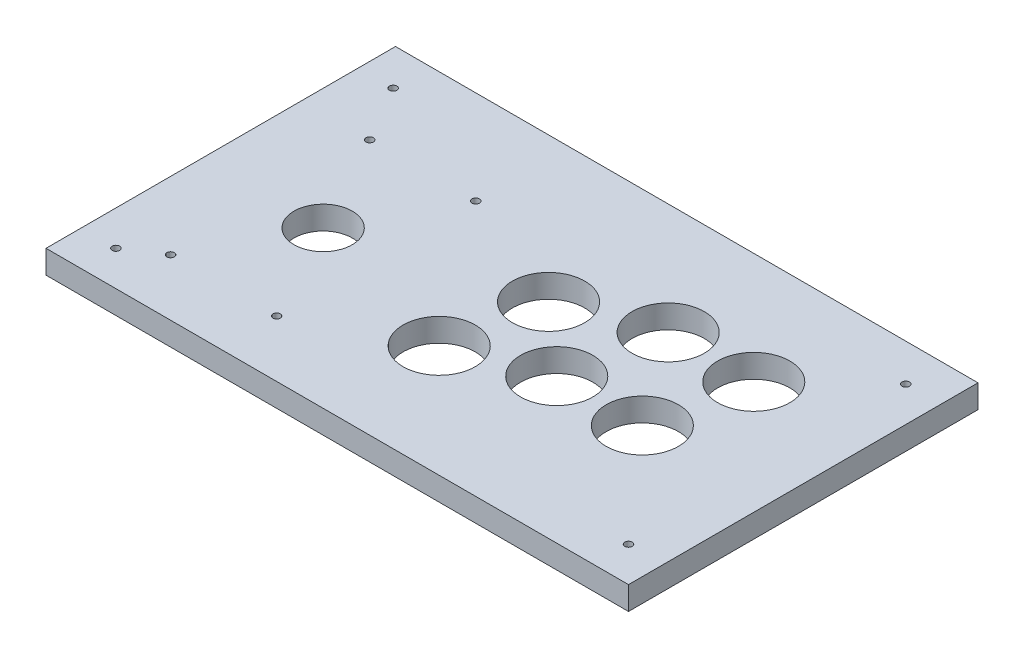
ISO-10303-21;
HEADER;
FILE_DESCRIPTION(('STEP AP214'),'2;1');
FILE_NAME('part.step','',(''),(''),'','','');
FILE_SCHEMA(('AUTOMOTIVE_DESIGN { 1 0 10303 214 1 1 1 1 }'));
ENDSEC;
DATA;
#1=APPLICATION_CONTEXT('core data for automotive mechanical design processes');
#2=APPLICATION_PROTOCOL_DEFINITION('international standard','automotive_design',2000,#1);
#3=PRODUCT_CONTEXT('',#1,'mechanical');
#4=PRODUCT('Part','Part','',(#3));
#5=PRODUCT_RELATED_PRODUCT_CATEGORY('part','',(#4));
#6=PRODUCT_DEFINITION_FORMATION('','',#4);
#7=PRODUCT_DEFINITION_CONTEXT('part definition',#1,'design');
#8=PRODUCT_DEFINITION('design','',#6,#7);
#9=PRODUCT_DEFINITION_SHAPE('','',#8);
#10=(LENGTH_UNIT() NAMED_UNIT(*) SI_UNIT(.MILLI.,.METRE.));
#11=(NAMED_UNIT(*) PLANE_ANGLE_UNIT() SI_UNIT($,.RADIAN.));
#12=(NAMED_UNIT(*) SI_UNIT($,.STERADIAN.) SOLID_ANGLE_UNIT());
#13=UNCERTAINTY_MEASURE_WITH_UNIT(LENGTH_MEASURE(1.E-05),#10,'distance_accuracy_value','');
#14=(GEOMETRIC_REPRESENTATION_CONTEXT(3) GLOBAL_UNCERTAINTY_ASSIGNED_CONTEXT((#13)) GLOBAL_UNIT_ASSIGNED_CONTEXT((#10,
#11,#12)) REPRESENTATION_CONTEXT('',''));
#15=CARTESIAN_POINT('',(0.,0.,0.));
#16=DIRECTION('',(0.,0.,1.));
#17=DIRECTION('',(1.,0.,0.));
#18=AXIS2_PLACEMENT_3D('',#15,#16,#17);
#19=CARTESIAN_POINT('',(125.,10.,-75.));
#20=DIRECTION('',(-1.,0.,0.));
#21=DIRECTION('',(0.,0.,1.));
#22=AXIS2_PLACEMENT_3D('',#19,#20,#21);
#23=PLANE('',#22);
#24=DIRECTION('',(0.,0.,-1.));
#25=VECTOR('',#24,1.);
#26=CARTESIAN_POINT('',(125.,0.,-75.));
#27=LINE('',#26,#25);
#28=CARTESIAN_POINT('',(125.,0.,75.));
#29=VERTEX_POINT('',#28);
#30=CARTESIAN_POINT('',(125.,0.,-75.));
#31=VERTEX_POINT('',#30);
#32=EDGE_CURVE('E96',#29,#31,#27,.T.);
#33=ORIENTED_EDGE('',*,*,#32,.T.);
#34=DIRECTION('',(0.,-1.,0.));
#35=VECTOR('',#34,1.);
#36=CARTESIAN_POINT('',(125.,10.,-75.));
#37=LINE('',#36,#35);
#38=CARTESIAN_POINT('',(125.,10.,-75.));
#39=VERTEX_POINT('',#38);
#40=EDGE_CURVE('E11',#39,#31,#37,.T.);
#41=ORIENTED_EDGE('',*,*,#40,.F.);
#42=DIRECTION('',(0.,0.,-1.));
#43=VECTOR('',#42,1.);
#44=CARTESIAN_POINT('',(125.,10.,-75.));
#45=LINE('',#44,#43);
#46=CARTESIAN_POINT('',(125.,10.,75.));
#47=VERTEX_POINT('',#46);
#48=EDGE_CURVE('E84',#47,#39,#45,.T.);
#49=ORIENTED_EDGE('',*,*,#48,.F.);
#50=DIRECTION('',(0.,-1.,0.));
#51=VECTOR('',#50,1.);
#52=CARTESIAN_POINT('',(125.,10.,75.));
#53=LINE('',#52,#51);
#54=EDGE_CURVE('E92',#47,#29,#53,.T.);
#55=ORIENTED_EDGE('',*,*,#54,.T.);
#56=EDGE_LOOP('',(#33,#41,#49,#55));
#57=FACE_BOUND('',#56,.T.);
#58=ADVANCED_FACE('F33',(#57),#23,.F.);
#59=CARTESIAN_POINT('',(-125.,10.,-75.));
#60=DIRECTION('',(0.,0.,1.));
#61=DIRECTION('',(1.,0.,0.));
#62=AXIS2_PLACEMENT_3D('',#59,#60,#61);
#63=PLANE('',#62);
#64=DIRECTION('',(-1.,0.,0.));
#65=VECTOR('',#64,1.);
#66=CARTESIAN_POINT('',(-125.,0.,-75.));
#67=LINE('',#66,#65);
#68=CARTESIAN_POINT('',(-125.,0.,-75.));
#69=VERTEX_POINT('',#68);
#70=EDGE_CURVE('E88',#31,#69,#67,.T.);
#71=ORIENTED_EDGE('',*,*,#70,.T.);
#72=DIRECTION('',(0.,-1.,0.));
#73=VECTOR('',#72,1.);
#74=CARTESIAN_POINT('',(-125.,10.,-75.));
#75=LINE('',#74,#73);
#76=CARTESIAN_POINT('',(-125.,10.,-75.));
#77=VERTEX_POINT('',#76);
#78=EDGE_CURVE('E41',#77,#69,#75,.T.);
#79=ORIENTED_EDGE('',*,*,#78,.F.);
#80=DIRECTION('',(-1.,0.,0.));
#81=VECTOR('',#80,1.);
#82=CARTESIAN_POINT('',(-125.,10.,-75.));
#83=LINE('',#82,#81);
#84=EDGE_CURVE('E79',#39,#77,#83,.T.);
#85=ORIENTED_EDGE('',*,*,#84,.F.);
#86=ORIENTED_EDGE('',*,*,#40,.T.);
#87=EDGE_LOOP('',(#71,#79,#85,#86));
#88=FACE_BOUND('',#87,.T.);
#89=ADVANCED_FACE('F87',(#88),#63,.F.);
#90=CARTESIAN_POINT('',(-125.,10.,-75.));
#91=DIRECTION('',(1.,0.,0.));
#92=DIRECTION('',(0.,0.,-1.));
#93=AXIS2_PLACEMENT_3D('',#90,#91,#92);
#94=PLANE('',#93);
#95=DIRECTION('',(0.,0.,1.));
#96=VECTOR('',#95,1.);
#97=CARTESIAN_POINT('',(-125.,0.,-75.));
#98=LINE('',#97,#96);
#99=CARTESIAN_POINT('',(-125.,0.,75.));
#100=VERTEX_POINT('',#99);
#101=EDGE_CURVE('E66',#69,#100,#98,.T.);
#102=ORIENTED_EDGE('',*,*,#101,.T.);
#103=DIRECTION('',(0.,-1.,0.));
#104=VECTOR('',#103,1.);
#105=CARTESIAN_POINT('',(-125.,10.,75.));
#106=LINE('',#105,#104);
#107=CARTESIAN_POINT('',(-125.,10.,75.));
#108=VERTEX_POINT('',#107);
#109=EDGE_CURVE('E89',#108,#100,#106,.T.);
#110=ORIENTED_EDGE('',*,*,#109,.F.);
#111=DIRECTION('',(0.,0.,1.));
#112=VECTOR('',#111,1.);
#113=CARTESIAN_POINT('',(-125.,10.,-75.));
#114=LINE('',#113,#112);
#115=EDGE_CURVE('E82',#77,#108,#114,.T.);
#116=ORIENTED_EDGE('',*,*,#115,.F.);
#117=ORIENTED_EDGE('',*,*,#78,.T.);
#118=EDGE_LOOP('',(#102,#110,#116,#117));
#119=FACE_BOUND('',#118,.T.);
#120=ADVANCED_FACE('F90',(#119),#94,.F.);
#121=CARTESIAN_POINT('',(-125.,10.,75.));
#122=DIRECTION('',(0.,0.,-1.));
#123=DIRECTION('',(-1.,0.,0.));
#124=AXIS2_PLACEMENT_3D('',#121,#122,#123);
#125=PLANE('',#124);
#126=DIRECTION('',(1.,0.,0.));
#127=VECTOR('',#126,1.);
#128=CARTESIAN_POINT('',(-125.,0.,75.));
#129=LINE('',#128,#127);
#130=EDGE_CURVE('E72',#100,#29,#129,.T.);
#131=ORIENTED_EDGE('',*,*,#130,.T.);
#132=ORIENTED_EDGE('',*,*,#54,.F.);
#133=DIRECTION('',(1.,0.,0.));
#134=VECTOR('',#133,1.);
#135=CARTESIAN_POINT('',(-125.,10.,75.));
#136=LINE('',#135,#134);
#137=EDGE_CURVE('E49',#108,#47,#136,.T.);
#138=ORIENTED_EDGE('',*,*,#137,.F.);
#139=ORIENTED_EDGE('',*,*,#109,.T.);
#140=EDGE_LOOP('',(#131,#132,#138,#139));
#141=FACE_BOUND('',#140,.T.);
#142=ADVANCED_FACE('F104',(#141),#125,.F.);
#143=CARTESIAN_POINT('',(0.,10.,0.));
#144=DIRECTION('',(0.,1.,0.));
#145=DIRECTION('',(0.,0.,1.));
#146=AXIS2_PLACEMENT_3D('',#143,#144,#145);
#147=PLANE('',#146);
#148=CARTESIAN_POINT('',(110.,10.,-59.));
#149=DIRECTION('',(0.,1.,0.));
#150=DIRECTION('',(0.,0.,1.));
#151=AXIS2_PLACEMENT_3D('',#148,#149,#150);
#152=CIRCLE('',#151,1.60000000000001);
#153=CARTESIAN_POINT('',(110.,10.,-57.4));
#154=VERTEX_POINT('',#153);
#155=EDGE_CURVE('E175',#154,#154,#152,.T.);
#156=ORIENTED_EDGE('',*,*,#155,.F.);
#157=EDGE_LOOP('',(#156));
#158=FACE_BOUND('',#157,.T.);
#159=CARTESIAN_POINT('',(110.,10.,60.));
#160=DIRECTION('',(0.,1.,0.));
#161=DIRECTION('',(0.,0.,1.));
#162=AXIS2_PLACEMENT_3D('',#159,#160,#161);
#163=CIRCLE('',#162,1.60000000000001);
#164=CARTESIAN_POINT('',(110.,10.,61.6));
#165=VERTEX_POINT('',#164);
#166=EDGE_CURVE('E169',#165,#165,#163,.T.);
#167=ORIENTED_EDGE('',*,*,#166,.F.);
#168=EDGE_LOOP('',(#167));
#169=FACE_BOUND('',#168,.T.);
#170=CARTESIAN_POINT('',(-110.,10.,60.));
#171=DIRECTION('',(0.,1.,0.));
#172=DIRECTION('',(0.,0.,1.));
#173=AXIS2_PLACEMENT_3D('',#170,#171,#172);
#174=CIRCLE('',#173,1.60000000000004);
#175=CARTESIAN_POINT('',(-110.,10.,61.6));
#176=VERTEX_POINT('',#175);
#177=EDGE_CURVE('E161',#176,#176,#174,.T.);
#178=ORIENTED_EDGE('',*,*,#177,.F.);
#179=EDGE_LOOP('',(#178));
#180=FACE_BOUND('',#179,.T.);
#181=CARTESIAN_POINT('',(-50.3526875876129,10.,-34.7670598371873));
#182=DIRECTION('',(0.,1.,0.));
#183=DIRECTION('',(0.,0.,1.));
#184=AXIS2_PLACEMENT_3D('',#181,#182,#183);
#185=CIRCLE('',#184,1.6);
#186=CARTESIAN_POINT('',(-50.3526875876129,10.,-33.1670598371873));
#187=VERTEX_POINT('',#186);
#188=EDGE_CURVE('E162',#187,#187,#185,.T.);
#189=ORIENTED_EDGE('',*,*,#188,.F.);
#190=EDGE_LOOP('',(#189));
#191=FACE_BOUND('',#190,.T.);
#192=CARTESIAN_POINT('',(-50.3526875875806,10.,50.6729401628127));
#193=DIRECTION('',(0.,1.,0.));
#194=DIRECTION('',(0.,0.,1.));
#195=AXIS2_PLACEMENT_3D('',#192,#193,#194);
#196=CIRCLE('',#195,1.6);
#197=CARTESIAN_POINT('',(-50.3526875875806,10.,52.2729401628127));
#198=VERTEX_POINT('',#197);
#199=EDGE_CURVE('E192',#198,#198,#196,.T.);
#200=ORIENTED_EDGE('',*,*,#199,.F.);
#201=EDGE_LOOP('',(#200));
#202=FACE_BOUND('',#201,.T.);
#203=CARTESIAN_POINT('',(-95.8526875875806,10.,50.6729401628299));
#204=DIRECTION('',(0.,1.,0.));
#205=DIRECTION('',(0.,0.,1.));
#206=AXIS2_PLACEMENT_3D('',#203,#204,#205);
#207=CIRCLE('',#206,1.60000000000001);
#208=CARTESIAN_POINT('',(-95.8526875875806,10.,52.2729401628299));
#209=VERTEX_POINT('',#208);
#210=EDGE_CURVE('E185',#209,#209,#207,.T.);
#211=ORIENTED_EDGE('',*,*,#210,.F.);
#212=EDGE_LOOP('',(#211));
#213=FACE_BOUND('',#212,.T.);
#214=CARTESIAN_POINT('',(-95.8526875876129,10.,-34.7670598371701));
#215=DIRECTION('',(0.,1.,0.));
#216=DIRECTION('',(0.,0.,1.));
#217=AXIS2_PLACEMENT_3D('',#214,#215,#216);
#218=CIRCLE('',#217,1.60000000000001);
#219=CARTESIAN_POINT('',(-95.8526875876129,10.,-33.1670598371701));
#220=VERTEX_POINT('',#219);
#221=EDGE_CURVE('E186',#220,#220,#218,.T.);
#222=ORIENTED_EDGE('',*,*,#221,.F.);
#223=EDGE_LOOP('',(#222));
#224=FACE_BOUND('',#223,.T.);
#225=CARTESIAN_POINT('',(-110.,10.,-59.));
#226=DIRECTION('',(0.,1.,0.));
#227=DIRECTION('',(0.,0.,1.));
#228=AXIS2_PLACEMENT_3D('',#225,#226,#227);
#229=CIRCLE('',#228,1.60000000000001);
#230=CARTESIAN_POINT('',(-110.,10.,-57.4));
#231=VERTEX_POINT('',#230);
#232=EDGE_CURVE('E154',#231,#231,#229,.T.);
#233=ORIENTED_EDGE('',*,*,#232,.F.);
#234=EDGE_LOOP('',(#233));
#235=FACE_BOUND('',#234,.T.);
#236=CARTESIAN_POINT('',(-73.1026875875966,10.,7.95294016282133));
#237=DIRECTION('',(0.,1.,0.));
#238=DIRECTION('',(0.,0.,1.));
#239=AXIS2_PLACEMENT_3D('',#236,#237,#238);
#240=CIRCLE('',#239,12.5);
#241=CARTESIAN_POINT('',(-73.1026875875966,10.,20.4529401628213));
#242=VERTEX_POINT('',#241);
#243=EDGE_CURVE('E133',#242,#242,#240,.T.);
#244=ORIENTED_EDGE('',*,*,#243,.F.);
#245=EDGE_LOOP('',(#244));
#246=FACE_BOUND('',#245,.T.);
#247=CARTESIAN_POINT('',(32.1135429575486,10.,12.9130445425026));
#248=DIRECTION('',(0.,1.,0.));
#249=DIRECTION('',(0.,0.,1.));
#250=AXIS2_PLACEMENT_3D('',#247,#248,#249);
#251=CIRCLE('',#250,15.5);
#252=CARTESIAN_POINT('',(32.1135429575486,10.,28.4130445425026));
#253=VERTEX_POINT('',#252);
#254=EDGE_CURVE('E140',#253,#253,#251,.T.);
#255=ORIENTED_EDGE('',*,*,#254,.F.);
#256=EDGE_LOOP('',(#255));
#257=FACE_BOUND('',#256,.T.);
#258=CARTESIAN_POINT('',(68.8512829705009,10.,12.9130445425026));
#259=DIRECTION('',(0.,1.,0.));
#260=DIRECTION('',(0.,0.,1.));
#261=AXIS2_PLACEMENT_3D('',#258,#259,#260);
#262=CIRCLE('',#261,15.5);
#263=CARTESIAN_POINT('',(68.8512829705009,10.,28.4130445425026));
#264=VERTEX_POINT('',#263);
#265=EDGE_CURVE('E139',#264,#264,#262,.T.);
#266=ORIENTED_EDGE('',*,*,#265,.F.);
#267=EDGE_LOOP('',(#266));
#268=FACE_BOUND('',#267,.T.);
#269=CARTESIAN_POINT('',(76.517860201895,10.,-27.2430515594399));
#270=DIRECTION('',(0.,1.,0.));
#271=DIRECTION('',(0.,0.,1.));
#272=AXIS2_PLACEMENT_3D('',#269,#270,#271);
#273=CIRCLE('',#272,15.5);
#274=CARTESIAN_POINT('',(76.517860201895,10.,-11.7430515594399));
#275=VERTEX_POINT('',#274);
#276=EDGE_CURVE('E114',#275,#275,#273,.T.);
#277=ORIENTED_EDGE('',*,*,#276,.F.);
#278=EDGE_LOOP('',(#277));
#279=FACE_BOUND('',#278,.T.);
#280=CARTESIAN_POINT('',(39.7814864631144,10.,-27.2430515594399));
#281=DIRECTION('',(0.,1.,0.));
#282=DIRECTION('',(0.,0.,1.));
#283=AXIS2_PLACEMENT_3D('',#280,#281,#282);
#284=CIRCLE('',#283,15.5);
#285=CARTESIAN_POINT('',(39.7814864631144,10.,-11.7430515594399));
#286=VERTEX_POINT('',#285);
#287=EDGE_CURVE('E113',#286,#286,#284,.T.);
#288=ORIENTED_EDGE('',*,*,#287,.F.);
#289=EDGE_LOOP('',(#288));
#290=FACE_BOUND('',#289,.T.);
#291=CARTESIAN_POINT('',(2.76504000908334,10.,-12.9308303596148));
#292=DIRECTION('',(0.,1.,0.));
#293=DIRECTION('',(0.,0.,1.));
#294=AXIS2_PLACEMENT_3D('',#291,#292,#293);
#295=CIRCLE('',#294,15.5);
#296=CARTESIAN_POINT('',(2.76504000908334,10.,2.56916964038518));
#297=VERTEX_POINT('',#296);
#298=EDGE_CURVE('E121',#297,#297,#295,.T.);
#299=ORIENTED_EDGE('',*,*,#298,.F.);
#300=EDGE_LOOP('',(#299));
#301=FACE_BOUND('',#300,.T.);
#302=CARTESIAN_POINT('',(-4.3708031809544,10.,26.878296525124));
#303=DIRECTION('',(0.,1.,0.));
#304=DIRECTION('',(0.,0.,1.));
#305=AXIS2_PLACEMENT_3D('',#302,#303,#304);
#306=CIRCLE('',#305,15.5);
#307=CARTESIAN_POINT('',(-4.3708031809544,10.,42.378296525124));
#308=VERTEX_POINT('',#307);
#309=EDGE_CURVE('E127',#308,#308,#306,.T.);
#310=ORIENTED_EDGE('',*,*,#309,.F.);
#311=EDGE_LOOP('',(#310));
#312=FACE_BOUND('',#311,.T.);
#313=ORIENTED_EDGE('',*,*,#48,.T.);
#314=ORIENTED_EDGE('',*,*,#84,.T.);
#315=ORIENTED_EDGE('',*,*,#115,.T.);
#316=ORIENTED_EDGE('',*,*,#137,.T.);
#317=EDGE_LOOP('',(#313,#314,#315,#316));
#318=FACE_BOUND('',#317,.T.);
#319=ADVANCED_FACE('F80',(#158,#169,#180,#191,#202,#213,#224,#235,#246,#257,#268,#279,#290,#301,
#312,#318),#147,.T.);
#320=CARTESIAN_POINT('',(0.,0.,0.));
#321=DIRECTION('',(0.,1.,0.));
#322=DIRECTION('',(0.,0.,1.));
#323=AXIS2_PLACEMENT_3D('',#320,#321,#322);
#324=PLANE('',#323);
#325=CARTESIAN_POINT('',(110.,0.,-59.));
#326=DIRECTION('',(0.,1.,0.));
#327=DIRECTION('',(0.,0.,1.));
#328=AXIS2_PLACEMENT_3D('',#325,#326,#327);
#329=CIRCLE('',#328,1.60000000000001);
#330=CARTESIAN_POINT('',(110.,0.,-57.4));
#331=VERTEX_POINT('',#330);
#332=EDGE_CURVE('E157',#331,#331,#329,.F.);
#333=ORIENTED_EDGE('',*,*,#332,.F.);
#334=EDGE_LOOP('',(#333));
#335=FACE_BOUND('',#334,.T.);
#336=CARTESIAN_POINT('',(110.,0.,60.));
#337=DIRECTION('',(0.,1.,0.));
#338=DIRECTION('',(0.,0.,1.));
#339=AXIS2_PLACEMENT_3D('',#336,#337,#338);
#340=CIRCLE('',#339,1.60000000000001);
#341=CARTESIAN_POINT('',(110.,0.,61.6));
#342=VERTEX_POINT('',#341);
#343=EDGE_CURVE('E172',#342,#342,#340,.F.);
#344=ORIENTED_EDGE('',*,*,#343,.F.);
#345=EDGE_LOOP('',(#344));
#346=FACE_BOUND('',#345,.T.);
#347=CARTESIAN_POINT('',(-110.,0.,60.));
#348=DIRECTION('',(0.,1.,0.));
#349=DIRECTION('',(0.,0.,1.));
#350=AXIS2_PLACEMENT_3D('',#347,#348,#349);
#351=CIRCLE('',#350,1.60000000000004);
#352=CARTESIAN_POINT('',(-110.,0.,61.6));
#353=VERTEX_POINT('',#352);
#354=EDGE_CURVE('E166',#353,#353,#351,.F.);
#355=ORIENTED_EDGE('',*,*,#354,.F.);
#356=EDGE_LOOP('',(#355));
#357=FACE_BOUND('',#356,.T.);
#358=CARTESIAN_POINT('',(-50.3526875876129,0.,-34.7670598371873));
#359=DIRECTION('',(0.,1.,0.));
#360=DIRECTION('',(0.,0.,1.));
#361=AXIS2_PLACEMENT_3D('',#358,#359,#360);
#362=CIRCLE('',#361,1.6);
#363=CARTESIAN_POINT('',(-50.3526875876129,0.,-33.1670598371873));
#364=VERTEX_POINT('',#363);
#365=EDGE_CURVE('E158',#364,#364,#362,.F.);
#366=ORIENTED_EDGE('',*,*,#365,.F.);
#367=EDGE_LOOP('',(#366));
#368=FACE_BOUND('',#367,.T.);
#369=CARTESIAN_POINT('',(-50.3526875875806,0.,50.6729401628127));
#370=DIRECTION('',(0.,1.,0.));
#371=DIRECTION('',(0.,0.,1.));
#372=AXIS2_PLACEMENT_3D('',#369,#370,#371);
#373=CIRCLE('',#372,1.6);
#374=CARTESIAN_POINT('',(-50.3526875875806,0.,52.2729401628127));
#375=VERTEX_POINT('',#374);
#376=EDGE_CURVE('E165',#375,#375,#373,.F.);
#377=ORIENTED_EDGE('',*,*,#376,.F.);
#378=EDGE_LOOP('',(#377));
#379=FACE_BOUND('',#378,.T.);
#380=CARTESIAN_POINT('',(-95.8526875875806,0.,50.6729401628299));
#381=DIRECTION('',(0.,1.,0.));
#382=DIRECTION('',(0.,0.,1.));
#383=AXIS2_PLACEMENT_3D('',#380,#381,#382);
#384=CIRCLE('',#383,1.60000000000001);
#385=CARTESIAN_POINT('',(-95.8526875875806,0.,52.2729401628299));
#386=VERTEX_POINT('',#385);
#387=EDGE_CURVE('E189',#386,#386,#384,.F.);
#388=ORIENTED_EDGE('',*,*,#387,.F.);
#389=EDGE_LOOP('',(#388));
#390=FACE_BOUND('',#389,.T.);
#391=CARTESIAN_POINT('',(-95.8526875876129,0.,-34.7670598371701));
#392=DIRECTION('',(0.,1.,0.));
#393=DIRECTION('',(0.,0.,1.));
#394=AXIS2_PLACEMENT_3D('',#391,#392,#393);
#395=CIRCLE('',#394,1.60000000000001);
#396=CARTESIAN_POINT('',(-95.8526875876129,0.,-33.1670598371701));
#397=VERTEX_POINT('',#396);
#398=EDGE_CURVE('E182',#397,#397,#395,.F.);
#399=ORIENTED_EDGE('',*,*,#398,.F.);
#400=EDGE_LOOP('',(#399));
#401=FACE_BOUND('',#400,.T.);
#402=CARTESIAN_POINT('',(-110.,0.,-59.));
#403=DIRECTION('',(0.,1.,0.));
#404=DIRECTION('',(0.,0.,1.));
#405=AXIS2_PLACEMENT_3D('',#402,#403,#404);
#406=CIRCLE('',#405,1.60000000000001);
#407=CARTESIAN_POINT('',(-110.,0.,-57.4));
#408=VERTEX_POINT('',#407);
#409=EDGE_CURVE('E143',#408,#408,#406,.F.);
#410=ORIENTED_EDGE('',*,*,#409,.F.);
#411=EDGE_LOOP('',(#410));
#412=FACE_BOUND('',#411,.T.);
#413=CARTESIAN_POINT('',(-73.1026875875966,0.,7.95294016282133));
#414=DIRECTION('',(0.,1.,0.));
#415=DIRECTION('',(0.,0.,1.));
#416=AXIS2_PLACEMENT_3D('',#413,#414,#415);
#417=CIRCLE('',#416,12.5);
#418=CARTESIAN_POINT('',(-73.1026875875966,0.,20.4529401628213));
#419=VERTEX_POINT('',#418);
#420=EDGE_CURVE('E99',#419,#419,#417,.F.);
#421=ORIENTED_EDGE('',*,*,#420,.F.);
#422=EDGE_LOOP('',(#421));
#423=FACE_BOUND('',#422,.T.);
#424=CARTESIAN_POINT('',(32.1135429575486,0.,12.9130445425026));
#425=DIRECTION('',(0.,1.,0.));
#426=DIRECTION('',(0.,0.,1.));
#427=AXIS2_PLACEMENT_3D('',#424,#425,#426);
#428=CIRCLE('',#427,15.5);
#429=CARTESIAN_POINT('',(32.1135429575486,0.,28.4130445425026));
#430=VERTEX_POINT('',#429);
#431=EDGE_CURVE('E136',#430,#430,#428,.F.);
#432=ORIENTED_EDGE('',*,*,#431,.F.);
#433=EDGE_LOOP('',(#432));
#434=FACE_BOUND('',#433,.T.);
#435=CARTESIAN_POINT('',(68.8512829705009,0.,12.9130445425026));
#436=DIRECTION('',(0.,1.,0.));
#437=DIRECTION('',(0.,0.,1.));
#438=AXIS2_PLACEMENT_3D('',#435,#436,#437);
#439=CIRCLE('',#438,15.5);
#440=CARTESIAN_POINT('',(68.8512829705009,0.,28.4130445425026));
#441=VERTEX_POINT('',#440);
#442=EDGE_CURVE('E117',#441,#441,#439,.F.);
#443=ORIENTED_EDGE('',*,*,#442,.F.);
#444=EDGE_LOOP('',(#443));
#445=FACE_BOUND('',#444,.T.);
#446=CARTESIAN_POINT('',(76.517860201895,0.,-27.2430515594399));
#447=DIRECTION('',(0.,1.,0.));
#448=DIRECTION('',(0.,0.,1.));
#449=AXIS2_PLACEMENT_3D('',#446,#447,#448);
#450=CIRCLE('',#449,15.5);
#451=CARTESIAN_POINT('',(76.517860201895,0.,-11.7430515594399));
#452=VERTEX_POINT('',#451);
#453=EDGE_CURVE('E110',#452,#452,#450,.F.);
#454=ORIENTED_EDGE('',*,*,#453,.F.);
#455=EDGE_LOOP('',(#454));
#456=FACE_BOUND('',#455,.T.);
#457=CARTESIAN_POINT('',(39.7814864631144,0.,-27.2430515594399));
#458=DIRECTION('',(0.,1.,0.));
#459=DIRECTION('',(0.,0.,1.));
#460=AXIS2_PLACEMENT_3D('',#457,#458,#459);
#461=CIRCLE('',#460,15.5);
#462=CARTESIAN_POINT('',(39.7814864631144,0.,-11.7430515594399));
#463=VERTEX_POINT('',#462);
#464=EDGE_CURVE('E118',#463,#463,#461,.F.);
#465=ORIENTED_EDGE('',*,*,#464,.F.);
#466=EDGE_LOOP('',(#465));
#467=FACE_BOUND('',#466,.T.);
#468=CARTESIAN_POINT('',(2.76504000908334,0.,-12.9308303596148));
#469=DIRECTION('',(0.,1.,0.));
#470=DIRECTION('',(0.,0.,1.));
#471=AXIS2_PLACEMENT_3D('',#468,#469,#470);
#472=CIRCLE('',#471,15.5);
#473=CARTESIAN_POINT('',(2.76504000908334,0.,2.56916964038518));
#474=VERTEX_POINT('',#473);
#475=EDGE_CURVE('E124',#474,#474,#472,.F.);
#476=ORIENTED_EDGE('',*,*,#475,.F.);
#477=EDGE_LOOP('',(#476));
#478=FACE_BOUND('',#477,.T.);
#479=CARTESIAN_POINT('',(-4.3708031809544,0.,26.878296525124));
#480=DIRECTION('',(0.,1.,0.));
#481=DIRECTION('',(0.,0.,1.));
#482=AXIS2_PLACEMENT_3D('',#479,#480,#481);
#483=CIRCLE('',#482,15.5);
#484=CARTESIAN_POINT('',(-4.3708031809544,0.,42.378296525124));
#485=VERTEX_POINT('',#484);
#486=EDGE_CURVE('E130',#485,#485,#483,.F.);
#487=ORIENTED_EDGE('',*,*,#486,.F.);
#488=EDGE_LOOP('',(#487));
#489=FACE_BOUND('',#488,.T.);
#490=ORIENTED_EDGE('',*,*,#32,.F.);
#491=ORIENTED_EDGE('',*,*,#130,.F.);
#492=ORIENTED_EDGE('',*,*,#101,.F.);
#493=ORIENTED_EDGE('',*,*,#70,.F.);
#494=EDGE_LOOP('',(#490,#491,#492,#493));
#495=FACE_BOUND('',#494,.T.);
#496=ADVANCED_FACE('F107',(#335,#346,#357,#368,#379,#390,#401,#412,#423,#434,#445,#456,#467,
#478,#489,#495),#324,.F.);
#497=CARTESIAN_POINT('',(-4.3708031809544,-0.000999999999999265,26.878296525124));
#498=DIRECTION('',(0.,1.,0.));
#499=DIRECTION('',(0.,0.,1.));
#500=AXIS2_PLACEMENT_3D('',#497,#498,#499);
#501=CYLINDRICAL_SURFACE('',#500,15.5);
#502=ORIENTED_EDGE('',*,*,#309,.T.);
#503=EDGE_LOOP('',(#502));
#504=FACE_BOUND('',#503,.T.);
#505=ORIENTED_EDGE('',*,*,#486,.T.);
#506=EDGE_LOOP('',(#505));
#507=FACE_BOUND('',#506,.T.);
#508=ADVANCED_FACE('F227',(#504,#507),#501,.F.);
#509=CARTESIAN_POINT('',(2.76504000908334,-0.000999999999999265,-12.9308303596148));
#510=DIRECTION('',(0.,1.,0.));
#511=DIRECTION('',(0.,0.,1.));
#512=AXIS2_PLACEMENT_3D('',#509,#510,#511);
#513=CYLINDRICAL_SURFACE('',#512,15.5);
#514=ORIENTED_EDGE('',*,*,#298,.T.);
#515=EDGE_LOOP('',(#514));
#516=FACE_BOUND('',#515,.T.);
#517=ORIENTED_EDGE('',*,*,#475,.T.);
#518=EDGE_LOOP('',(#517));
#519=FACE_BOUND('',#518,.T.);
#520=ADVANCED_FACE('F230',(#516,#519),#513,.F.);
#521=CARTESIAN_POINT('',(39.7814864631144,-0.000999999999999265,-27.2430515594399));
#522=DIRECTION('',(0.,1.,0.));
#523=DIRECTION('',(0.,0.,1.));
#524=AXIS2_PLACEMENT_3D('',#521,#522,#523);
#525=CYLINDRICAL_SURFACE('',#524,15.5);
#526=ORIENTED_EDGE('',*,*,#287,.T.);
#527=EDGE_LOOP('',(#526));
#528=FACE_BOUND('',#527,.T.);
#529=ORIENTED_EDGE('',*,*,#464,.T.);
#530=EDGE_LOOP('',(#529));
#531=FACE_BOUND('',#530,.T.);
#532=ADVANCED_FACE('F368',(#528,#531),#525,.F.);
#533=CARTESIAN_POINT('',(76.517860201895,-0.000999999999999265,-27.2430515594399));
#534=DIRECTION('',(0.,1.,0.));
#535=DIRECTION('',(0.,0.,1.));
#536=AXIS2_PLACEMENT_3D('',#533,#534,#535);
#537=CYLINDRICAL_SURFACE('',#536,15.5);
#538=ORIENTED_EDGE('',*,*,#276,.T.);
#539=EDGE_LOOP('',(#538));
#540=FACE_BOUND('',#539,.T.);
#541=ORIENTED_EDGE('',*,*,#453,.T.);
#542=EDGE_LOOP('',(#541));
#543=FACE_BOUND('',#542,.T.);
#544=ADVANCED_FACE('F361',(#540,#543),#537,.F.);
#545=CARTESIAN_POINT('',(68.8512829705009,-0.000999999999999265,12.9130445425026));
#546=DIRECTION('',(0.,1.,0.));
#547=DIRECTION('',(0.,0.,1.));
#548=AXIS2_PLACEMENT_3D('',#545,#546,#547);
#549=CYLINDRICAL_SURFACE('',#548,15.5);
#550=ORIENTED_EDGE('',*,*,#265,.T.);
#551=EDGE_LOOP('',(#550));
#552=FACE_BOUND('',#551,.T.);
#553=ORIENTED_EDGE('',*,*,#442,.T.);
#554=EDGE_LOOP('',(#553));
#555=FACE_BOUND('',#554,.T.);
#556=ADVANCED_FACE('F358',(#552,#555),#549,.F.);
#557=CARTESIAN_POINT('',(32.1135429575486,-0.000999999999999265,12.9130445425026));
#558=DIRECTION('',(0.,1.,0.));
#559=DIRECTION('',(0.,0.,1.));
#560=AXIS2_PLACEMENT_3D('',#557,#558,#559);
#561=CYLINDRICAL_SURFACE('',#560,15.5);
#562=ORIENTED_EDGE('',*,*,#254,.T.);
#563=EDGE_LOOP('',(#562));
#564=FACE_BOUND('',#563,.T.);
#565=ORIENTED_EDGE('',*,*,#431,.T.);
#566=EDGE_LOOP('',(#565));
#567=FACE_BOUND('',#566,.T.);
#568=ADVANCED_FACE('F356',(#564,#567),#561,.F.);
#569=CARTESIAN_POINT('',(-73.1026875875966,-0.000999999999999265,7.95294016282133));
#570=DIRECTION('',(0.,1.,0.));
#571=DIRECTION('',(0.,0.,1.));
#572=AXIS2_PLACEMENT_3D('',#569,#570,#571);
#573=CYLINDRICAL_SURFACE('',#572,12.5);
#574=ORIENTED_EDGE('',*,*,#243,.T.);
#575=EDGE_LOOP('',(#574));
#576=FACE_BOUND('',#575,.T.);
#577=ORIENTED_EDGE('',*,*,#420,.T.);
#578=EDGE_LOOP('',(#577));
#579=FACE_BOUND('',#578,.T.);
#580=ADVANCED_FACE('F266',(#576,#579),#573,.F.);
#581=CARTESIAN_POINT('',(-110.,-0.000999999999999265,-59.));
#582=DIRECTION('',(0.,1.,0.));
#583=DIRECTION('',(0.,0.,1.));
#584=AXIS2_PLACEMENT_3D('',#581,#582,#583);
#585=CYLINDRICAL_SURFACE('',#584,1.60000000000001);
#586=ORIENTED_EDGE('',*,*,#232,.T.);
#587=EDGE_LOOP('',(#586));
#588=FACE_BOUND('',#587,.T.);
#589=ORIENTED_EDGE('',*,*,#409,.T.);
#590=EDGE_LOOP('',(#589));
#591=FACE_BOUND('',#590,.T.);
#592=ADVANCED_FACE('F276',(#588,#591),#585,.F.);
#593=CARTESIAN_POINT('',(-95.8526875876129,-0.000999999999999265,-34.7670598371701));
#594=DIRECTION('',(0.,1.,0.));
#595=DIRECTION('',(0.,0.,1.));
#596=AXIS2_PLACEMENT_3D('',#593,#594,#595);
#597=CYLINDRICAL_SURFACE('',#596,1.60000000000001);
#598=ORIENTED_EDGE('',*,*,#221,.T.);
#599=EDGE_LOOP('',(#598));
#600=FACE_BOUND('',#599,.T.);
#601=ORIENTED_EDGE('',*,*,#398,.T.);
#602=EDGE_LOOP('',(#601));
#603=FACE_BOUND('',#602,.T.);
#604=ADVANCED_FACE('F281',(#600,#603),#597,.F.);
#605=CARTESIAN_POINT('',(-95.8526875875806,-0.000999999999999265,50.6729401628299));
#606=DIRECTION('',(0.,1.,0.));
#607=DIRECTION('',(0.,0.,1.));
#608=AXIS2_PLACEMENT_3D('',#605,#606,#607);
#609=CYLINDRICAL_SURFACE('',#608,1.60000000000001);
#610=ORIENTED_EDGE('',*,*,#210,.T.);
#611=EDGE_LOOP('',(#610));
#612=FACE_BOUND('',#611,.T.);
#613=ORIENTED_EDGE('',*,*,#387,.T.);
#614=EDGE_LOOP('',(#613));
#615=FACE_BOUND('',#614,.T.);
#616=ADVANCED_FACE('F291',(#612,#615),#609,.F.);
#617=CARTESIAN_POINT('',(-50.3526875875806,-0.000999999999999265,50.6729401628127));
#618=DIRECTION('',(0.,1.,0.));
#619=DIRECTION('',(0.,0.,1.));
#620=AXIS2_PLACEMENT_3D('',#617,#618,#619);
#621=CYLINDRICAL_SURFACE('',#620,1.6);
#622=ORIENTED_EDGE('',*,*,#199,.T.);
#623=EDGE_LOOP('',(#622));
#624=FACE_BOUND('',#623,.T.);
#625=ORIENTED_EDGE('',*,*,#376,.T.);
#626=EDGE_LOOP('',(#625));
#627=FACE_BOUND('',#626,.T.);
#628=ADVANCED_FACE('F200',(#624,#627),#621,.F.);
#629=CARTESIAN_POINT('',(-50.3526875876129,-0.000999999999999265,-34.7670598371873));
#630=DIRECTION('',(0.,1.,0.));
#631=DIRECTION('',(0.,0.,1.));
#632=AXIS2_PLACEMENT_3D('',#629,#630,#631);
#633=CYLINDRICAL_SURFACE('',#632,1.6);
#634=ORIENTED_EDGE('',*,*,#188,.T.);
#635=EDGE_LOOP('',(#634));
#636=FACE_BOUND('',#635,.T.);
#637=ORIENTED_EDGE('',*,*,#365,.T.);
#638=EDGE_LOOP('',(#637));
#639=FACE_BOUND('',#638,.T.);
#640=ADVANCED_FACE('F310',(#636,#639),#633,.F.);
#641=CARTESIAN_POINT('',(-110.,-0.000999999999999265,60.));
#642=DIRECTION('',(0.,1.,0.));
#643=DIRECTION('',(0.,0.,1.));
#644=AXIS2_PLACEMENT_3D('',#641,#642,#643);
#645=CYLINDRICAL_SURFACE('',#644,1.60000000000004);
#646=ORIENTED_EDGE('',*,*,#177,.T.);
#647=EDGE_LOOP('',(#646));
#648=FACE_BOUND('',#647,.T.);
#649=ORIENTED_EDGE('',*,*,#354,.T.);
#650=EDGE_LOOP('',(#649));
#651=FACE_BOUND('',#650,.T.);
#652=ADVANCED_FACE('F319',(#648,#651),#645,.F.);
#653=CARTESIAN_POINT('',(110.,-0.000999999999999265,60.));
#654=DIRECTION('',(0.,1.,0.));
#655=DIRECTION('',(0.,0.,1.));
#656=AXIS2_PLACEMENT_3D('',#653,#654,#655);
#657=CYLINDRICAL_SURFACE('',#656,1.60000000000001);
#658=ORIENTED_EDGE('',*,*,#166,.T.);
#659=EDGE_LOOP('',(#658));
#660=FACE_BOUND('',#659,.T.);
#661=ORIENTED_EDGE('',*,*,#343,.T.);
#662=EDGE_LOOP('',(#661));
#663=FACE_BOUND('',#662,.T.);
#664=ADVANCED_FACE('F329',(#660,#663),#657,.F.);
#665=CARTESIAN_POINT('',(110.,-0.000999999999999265,-59.));
#666=DIRECTION('',(0.,1.,0.));
#667=DIRECTION('',(0.,0.,1.));
#668=AXIS2_PLACEMENT_3D('',#665,#666,#667);
#669=CYLINDRICAL_SURFACE('',#668,1.60000000000001);
#670=ORIENTED_EDGE('',*,*,#155,.T.);
#671=EDGE_LOOP('',(#670));
#672=FACE_BOUND('',#671,.T.);
#673=ORIENTED_EDGE('',*,*,#332,.T.);
#674=EDGE_LOOP('',(#673));
#675=FACE_BOUND('',#674,.T.);
#676=ADVANCED_FACE('F339',(#672,#675),#669,.F.);
#677=CLOSED_SHELL('',(#58,#89,#120,#142,#319,#496,#508,#520,#532,#544,#556,#568,#580,#592,#604,
#616,#628,#640,#652,#664,#676));
#678=MANIFOLD_SOLID_BREP('B2',#677);
#679=ADVANCED_BREP_SHAPE_REPRESENTATION('',(#18,#678),#14);
#680=SHAPE_DEFINITION_REPRESENTATION(#9,#679);
ENDSEC;
END-ISO-10303-21;
